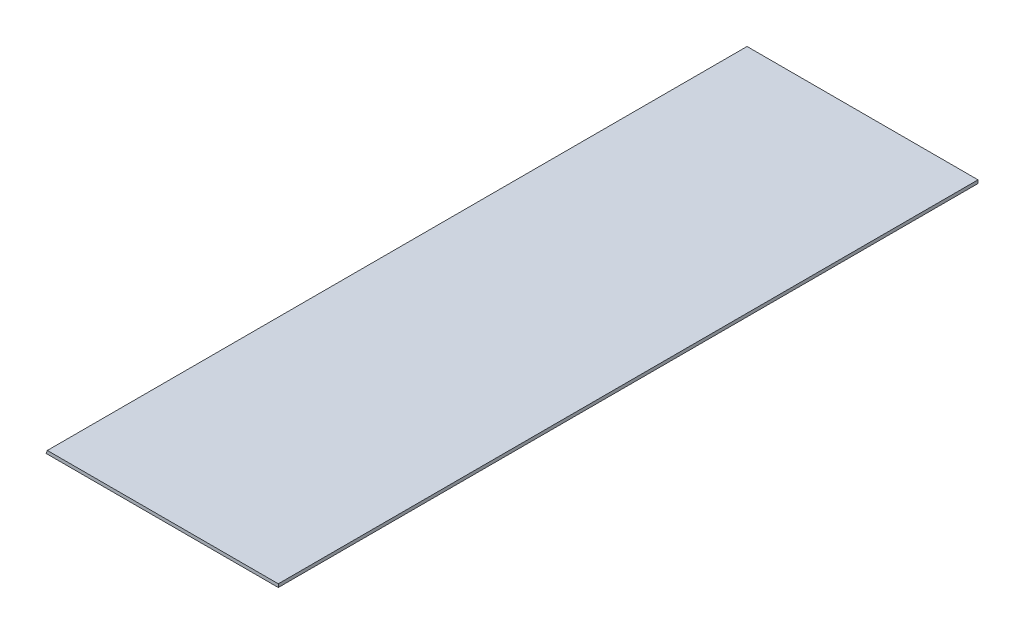
ISO-10303-21;
HEADER;
FILE_DESCRIPTION(('STEP AP214'),'2;1');
FILE_NAME('part.step','',(''),(''),'','','');
FILE_SCHEMA(('AUTOMOTIVE_DESIGN { 1 0 10303 214 1 1 1 1 }'));
ENDSEC;
DATA;
#1=APPLICATION_CONTEXT('core data for automotive mechanical design processes');
#2=APPLICATION_PROTOCOL_DEFINITION('international standard','automotive_design',2000,#1);
#3=PRODUCT_CONTEXT('',#1,'mechanical');
#4=PRODUCT('Part','Part','',(#3));
#5=PRODUCT_RELATED_PRODUCT_CATEGORY('part','',(#4));
#6=PRODUCT_DEFINITION_FORMATION('','',#4);
#7=PRODUCT_DEFINITION_CONTEXT('part definition',#1,'design');
#8=PRODUCT_DEFINITION('design','',#6,#7);
#9=PRODUCT_DEFINITION_SHAPE('','',#8);
#10=(LENGTH_UNIT() NAMED_UNIT(*) SI_UNIT(.MILLI.,.METRE.));
#11=(NAMED_UNIT(*) PLANE_ANGLE_UNIT() SI_UNIT($,.RADIAN.));
#12=(NAMED_UNIT(*) SI_UNIT($,.STERADIAN.) SOLID_ANGLE_UNIT());
#13=UNCERTAINTY_MEASURE_WITH_UNIT(LENGTH_MEASURE(1.E-05),#10,'distance_accuracy_value','');
#14=(GEOMETRIC_REPRESENTATION_CONTEXT(3) GLOBAL_UNCERTAINTY_ASSIGNED_CONTEXT((#13)) GLOBAL_UNIT_ASSIGNED_CONTEXT((#10,
#11,#12)) REPRESENTATION_CONTEXT('',''));
#15=CARTESIAN_POINT('',(0.,0.,0.));
#16=DIRECTION('',(0.,0.,1.));
#17=DIRECTION('',(1.,0.,0.));
#18=AXIS2_PLACEMENT_3D('',#15,#16,#17);
#19=CARTESIAN_POINT('',(168.656,0.,508.));
#20=DIRECTION('',(0.,1.,0.));
#21=DIRECTION('',(-1.,0.,0.));
#22=AXIS2_PLACEMENT_3D('',#19,#20,#21);
#23=PLANE('',#22);
#24=DIRECTION('',(1.,0.,0.));
#25=VECTOR('',#24,1.);
#26=CARTESIAN_POINT('',(168.656,0.,0.));
#27=LINE('',#26,#25);
#28=CARTESIAN_POINT('',(0.,0.,0.));
#29=VERTEX_POINT('',#28);
#30=CARTESIAN_POINT('',(168.656,0.,0.));
#31=VERTEX_POINT('',#30);
#32=EDGE_CURVE('E98',#29,#31,#27,.T.);
#33=ORIENTED_EDGE('',*,*,#32,.T.);
#34=DIRECTION('',(0.,0.,-1.));
#35=VECTOR('',#34,1.);
#36=CARTESIAN_POINT('',(168.656,0.,508.));
#37=LINE('',#36,#35);
#38=CARTESIAN_POINT('',(168.656,0.,508.));
#39=VERTEX_POINT('',#38);
#40=EDGE_CURVE('E11',#39,#31,#37,.T.);
#41=ORIENTED_EDGE('',*,*,#40,.F.);
#42=DIRECTION('',(1.,0.,0.));
#43=VECTOR('',#42,1.);
#44=CARTESIAN_POINT('',(168.656,0.,508.));
#45=LINE('',#44,#43);
#46=CARTESIAN_POINT('',(0.,0.,508.));
#47=VERTEX_POINT('',#46);
#48=EDGE_CURVE('E86',#47,#39,#45,.T.);
#49=ORIENTED_EDGE('',*,*,#48,.F.);
#50=DIRECTION('',(0.,0.,-1.));
#51=VECTOR('',#50,1.);
#52=CARTESIAN_POINT('',(0.,0.,508.));
#53=LINE('',#52,#51);
#54=EDGE_CURVE('E94',#47,#29,#53,.T.);
#55=ORIENTED_EDGE('',*,*,#54,.T.);
#56=EDGE_LOOP('',(#33,#41,#49,#55));
#57=FACE_BOUND('',#56,.T.);
#58=ADVANCED_FACE('F35',(#57),#23,.F.);
#59=CARTESIAN_POINT('',(168.656,2.3622,508.));
#60=DIRECTION('',(-1.,0.,0.));
#61=DIRECTION('',(0.,0.,1.));
#62=AXIS2_PLACEMENT_3D('',#59,#60,#61);
#63=PLANE('',#62);
#64=DIRECTION('',(0.,1.,0.));
#65=VECTOR('',#64,1.);
#66=CARTESIAN_POINT('',(168.656,2.3622,0.));
#67=LINE('',#66,#65);
#68=CARTESIAN_POINT('',(168.656,2.3622,0.));
#69=VERTEX_POINT('',#68);
#70=EDGE_CURVE('E90',#31,#69,#67,.T.);
#71=ORIENTED_EDGE('',*,*,#70,.T.);
#72=DIRECTION('',(0.,0.,-1.));
#73=VECTOR('',#72,1.);
#74=CARTESIAN_POINT('',(168.656,2.3622,508.));
#75=LINE('',#74,#73);
#76=CARTESIAN_POINT('',(168.656,2.3622,508.));
#77=VERTEX_POINT('',#76);
#78=EDGE_CURVE('E43',#77,#69,#75,.T.);
#79=ORIENTED_EDGE('',*,*,#78,.F.);
#80=DIRECTION('',(0.,1.,0.));
#81=VECTOR('',#80,1.);
#82=CARTESIAN_POINT('',(168.656,2.3622,508.));
#83=LINE('',#82,#81);
#84=EDGE_CURVE('E81',#39,#77,#83,.T.);
#85=ORIENTED_EDGE('',*,*,#84,.F.);
#86=ORIENTED_EDGE('',*,*,#40,.T.);
#87=EDGE_LOOP('',(#71,#79,#85,#86));
#88=FACE_BOUND('',#87,.T.);
#89=ADVANCED_FACE('F89',(#88),#63,.F.);
#90=CARTESIAN_POINT('',(0.978455277037736,2.3622,508.));
#91=DIRECTION('',(0.,-1.,0.));
#92=DIRECTION('',(1.,0.,0.));
#93=AXIS2_PLACEMENT_3D('',#90,#91,#92);
#94=PLANE('',#93);
#95=DIRECTION('',(-1.,0.,0.));
#96=VECTOR('',#95,1.);
#97=CARTESIAN_POINT('',(0.978455277037736,2.3622,0.));
#98=LINE('',#97,#96);
#99=CARTESIAN_POINT('',(0.978455277037736,2.3622,0.));
#100=VERTEX_POINT('',#99);
#101=EDGE_CURVE('E68',#69,#100,#98,.T.);
#102=ORIENTED_EDGE('',*,*,#101,.T.);
#103=DIRECTION('',(0.,0.,-1.));
#104=VECTOR('',#103,1.);
#105=CARTESIAN_POINT('',(0.978455277037736,2.3622,508.));
#106=LINE('',#105,#104);
#107=CARTESIAN_POINT('',(0.978455277037736,2.3622,508.));
#108=VERTEX_POINT('',#107);
#109=EDGE_CURVE('E91',#108,#100,#106,.T.);
#110=ORIENTED_EDGE('',*,*,#109,.F.);
#111=DIRECTION('',(-1.,0.,0.));
#112=VECTOR('',#111,1.);
#113=CARTESIAN_POINT('',(0.978455277037736,2.3622,508.));
#114=LINE('',#113,#112);
#115=EDGE_CURVE('E84',#77,#108,#114,.T.);
#116=ORIENTED_EDGE('',*,*,#115,.F.);
#117=ORIENTED_EDGE('',*,*,#78,.T.);
#118=EDGE_LOOP('',(#102,#110,#116,#117));
#119=FACE_BOUND('',#118,.T.);
#120=ADVANCED_FACE('F92',(#119),#94,.F.);
#121=CARTESIAN_POINT('',(0.,0.,508.));
#122=DIRECTION('',(0.923879532511285,-0.382683432365094,0.));
#123=DIRECTION('',(0.382683432365094,0.923879532511285,0.));
#124=AXIS2_PLACEMENT_3D('',#121,#122,#123);
#125=PLANE('',#124);
#126=DIRECTION('',(-0.382683432365094,-0.923879532511285,0.));
#127=VECTOR('',#126,1.);
#128=CARTESIAN_POINT('',(0.,0.,0.));
#129=LINE('',#128,#127);
#130=EDGE_CURVE('E74',#100,#29,#129,.T.);
#131=ORIENTED_EDGE('',*,*,#130,.T.);
#132=ORIENTED_EDGE('',*,*,#54,.F.);
#133=DIRECTION('',(-0.382683432365094,-0.923879532511285,0.));
#134=VECTOR('',#133,1.);
#135=CARTESIAN_POINT('',(0.,0.,508.));
#136=LINE('',#135,#134);
#137=EDGE_CURVE('E51',#108,#47,#136,.T.);
#138=ORIENTED_EDGE('',*,*,#137,.F.);
#139=ORIENTED_EDGE('',*,*,#109,.T.);
#140=EDGE_LOOP('',(#131,#132,#138,#139));
#141=FACE_BOUND('',#140,.T.);
#142=ADVANCED_FACE('F105',(#141),#125,.F.);
#143=CARTESIAN_POINT('',(0.,0.,508.));
#144=DIRECTION('',(0.,0.,1.));
#145=DIRECTION('',(1.,0.,0.));
#146=AXIS2_PLACEMENT_3D('',#143,#144,#145);
#147=PLANE('',#146);
#148=ORIENTED_EDGE('',*,*,#48,.T.);
#149=ORIENTED_EDGE('',*,*,#84,.T.);
#150=ORIENTED_EDGE('',*,*,#115,.T.);
#151=ORIENTED_EDGE('',*,*,#137,.T.);
#152=EDGE_LOOP('',(#148,#149,#150,#151));
#153=FACE_BOUND('',#152,.T.);
#154=ADVANCED_FACE('F82',(#153),#147,.T.);
#155=CARTESIAN_POINT('',(0.,0.,0.));
#156=DIRECTION('',(0.,0.,1.));
#157=DIRECTION('',(1.,0.,0.));
#158=AXIS2_PLACEMENT_3D('',#155,#156,#157);
#159=PLANE('',#158);
#160=ORIENTED_EDGE('',*,*,#32,.F.);
#161=ORIENTED_EDGE('',*,*,#130,.F.);
#162=ORIENTED_EDGE('',*,*,#101,.F.);
#163=ORIENTED_EDGE('',*,*,#70,.F.);
#164=EDGE_LOOP('',(#160,#161,#162,#163));
#165=FACE_BOUND('',#164,.T.);
#166=ADVANCED_FACE('F108',(#165),#159,.F.);
#167=CLOSED_SHELL('',(#58,#89,#120,#142,#154,#166));
#168=MANIFOLD_SOLID_BREP('B2',#167);
#169=ADVANCED_BREP_SHAPE_REPRESENTATION('',(#18,#168),#14);
#170=SHAPE_DEFINITION_REPRESENTATION(#9,#169);
ENDSEC;
END-ISO-10303-21;
